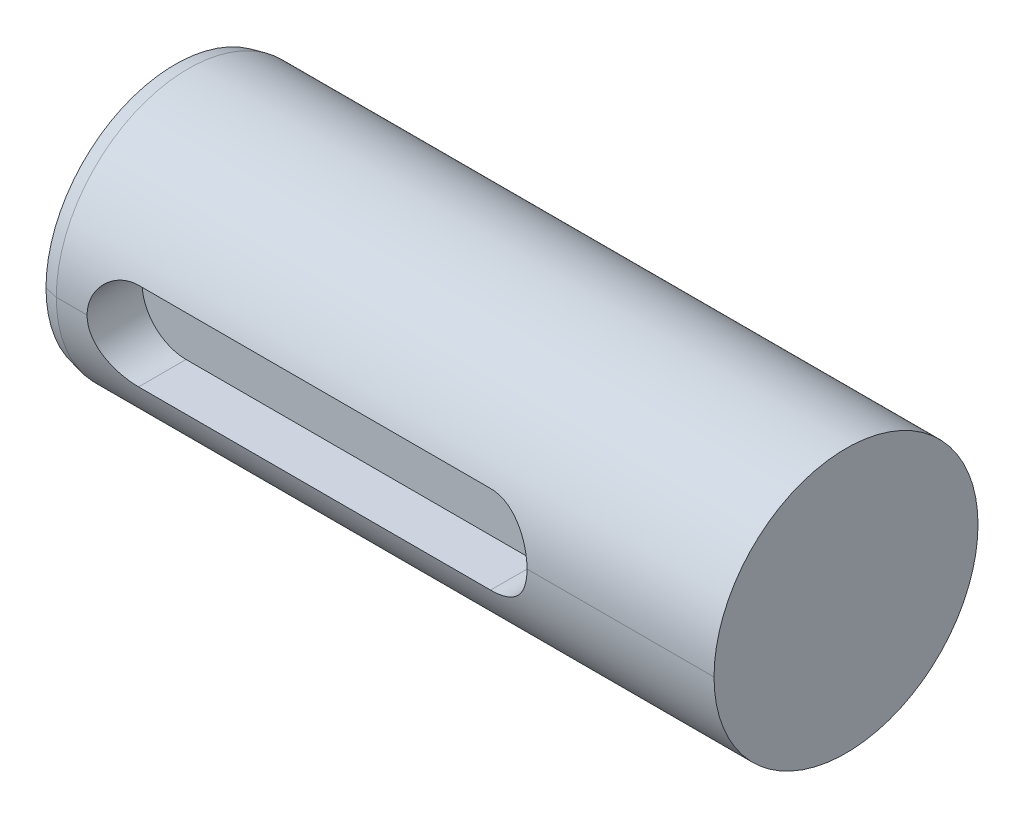
ISO-10303-21;
HEADER;
FILE_DESCRIPTION(('STEP AP214'),'2;1');
FILE_NAME('part.step','',(''),(''),'','','');
FILE_SCHEMA(('AUTOMOTIVE_DESIGN { 1 0 10303 214 1 1 1 1 }'));
ENDSEC;
DATA;
#1=APPLICATION_CONTEXT('core data for automotive mechanical design processes');
#2=APPLICATION_PROTOCOL_DEFINITION('international standard','automotive_design',2000,#1);
#3=PRODUCT_CONTEXT('',#1,'mechanical');
#4=PRODUCT('Part','Part','',(#3));
#5=PRODUCT_RELATED_PRODUCT_CATEGORY('part','',(#4));
#6=PRODUCT_DEFINITION_FORMATION('','',#4);
#7=PRODUCT_DEFINITION_CONTEXT('part definition',#1,'design');
#8=PRODUCT_DEFINITION('design','',#6,#7);
#9=PRODUCT_DEFINITION_SHAPE('','',#8);
#10=(LENGTH_UNIT() NAMED_UNIT(*) SI_UNIT(.MILLI.,.METRE.));
#11=(NAMED_UNIT(*) PLANE_ANGLE_UNIT() SI_UNIT($,.RADIAN.));
#12=(NAMED_UNIT(*) SI_UNIT($,.STERADIAN.) SOLID_ANGLE_UNIT());
#13=UNCERTAINTY_MEASURE_WITH_UNIT(LENGTH_MEASURE(1.E-05),#10,'distance_accuracy_value','');
#14=(GEOMETRIC_REPRESENTATION_CONTEXT(3) GLOBAL_UNCERTAINTY_ASSIGNED_CONTEXT((#13)) GLOBAL_UNIT_ASSIGNED_CONTEXT((#10,
#11,#12)) REPRESENTATION_CONTEXT('',''));
#15=CARTESIAN_POINT('',(0.,0.,0.));
#16=DIRECTION('',(0.,0.,1.));
#17=DIRECTION('',(1.,0.,0.));
#18=AXIS2_PLACEMENT_3D('',#15,#16,#17);
#19=CARTESIAN_POINT('',(-29.5,0.,0.));
#20=DIRECTION('',(-1.,0.,0.));
#21=DIRECTION('',(0.,0.,1.));
#22=AXIS2_PLACEMENT_3D('',#19,#20,#21);
#23=PLANE('',#22);
#24=CARTESIAN_POINT('',(-29.5,0.,0.));
#25=DIRECTION('',(1.,0.,0.));
#26=DIRECTION('',(0.,0.,1.));
#27=AXIS2_PLACEMENT_3D('',#24,#25,#26);
#28=CIRCLE('',#27,1.675);
#29=CARTESIAN_POINT('',(-29.5,0.,1.675));
#30=VERTEX_POINT('',#29);
#31=CARTESIAN_POINT('',(-29.5,0.,-1.675));
#32=VERTEX_POINT('',#31);
#33=EDGE_CURVE('E278',#30,#32,#28,.T.);
#34=ORIENTED_EDGE('',*,*,#33,.T.);
#35=CARTESIAN_POINT('',(-29.5,0.,0.));
#36=DIRECTION('',(1.,0.,0.));
#37=DIRECTION('',(0.,0.,1.));
#38=AXIS2_PLACEMENT_3D('',#35,#36,#37);
#39=CIRCLE('',#38,1.675);
#40=EDGE_CURVE('E273',#32,#30,#39,.T.);
#41=ORIENTED_EDGE('',*,*,#40,.T.);
#42=EDGE_LOOP('',(#34,#41));
#43=FACE_BOUND('',#42,.T.);
#44=CARTESIAN_POINT('',(-29.5,0.,0.));
#45=DIRECTION('',(-1.,0.,0.));
#46=DIRECTION('',(0.,0.,1.));
#47=AXIS2_PLACEMENT_3D('',#44,#45,#46);
#48=CIRCLE('',#47,5.8669832024);
#49=CARTESIAN_POINT('',(-29.5,0.,5.8669832024));
#50=VERTEX_POINT('',#49);
#51=CARTESIAN_POINT('',(-29.5,0.,-5.8669832024));
#52=VERTEX_POINT('',#51);
#53=EDGE_CURVE('E258',#50,#52,#48,.T.);
#54=ORIENTED_EDGE('',*,*,#53,.T.);
#55=CARTESIAN_POINT('',(-29.5,0.,0.));
#56=DIRECTION('',(-1.,0.,0.));
#57=DIRECTION('',(0.,0.,1.));
#58=AXIS2_PLACEMENT_3D('',#55,#56,#57);
#59=CIRCLE('',#58,5.8669832024);
#60=EDGE_CURVE('E28',#52,#50,#59,.T.);
#61=ORIENTED_EDGE('',*,*,#60,.T.);
#62=EDGE_LOOP('',(#54,#61));
#63=FACE_BOUND('',#62,.T.);
#64=ADVANCED_FACE('F17',(#43,#63),#23,.T.);
#65=CARTESIAN_POINT('',(1.,0.,0.));
#66=DIRECTION('',(1.,0.,0.));
#67=DIRECTION('',(0.,1.,0.));
#68=AXIS2_PLACEMENT_3D('',#65,#66,#67);
#69=PLANE('',#68);
#70=CARTESIAN_POINT('',(1.,0.,0.));
#71=DIRECTION('',(1.,0.,0.));
#72=DIRECTION('',(0.,0.,-1.));
#73=AXIS2_PLACEMENT_3D('',#70,#71,#72);
#74=CIRCLE('',#73,6.);
#75=CARTESIAN_POINT('',(1.,0.,-6.));
#76=VERTEX_POINT('',#75);
#77=CARTESIAN_POINT('',(1.,0.,6.));
#78=VERTEX_POINT('',#77);
#79=EDGE_CURVE('E11',#76,#78,#74,.T.);
#80=ORIENTED_EDGE('',*,*,#79,.T.);
#81=CARTESIAN_POINT('',(1.,0.,0.));
#82=DIRECTION('',(1.,0.,0.));
#83=DIRECTION('',(0.,0.,-1.));
#84=AXIS2_PLACEMENT_3D('',#81,#82,#83);
#85=CIRCLE('',#84,6.);
#86=EDGE_CURVE('E229',#78,#76,#85,.T.);
#87=ORIENTED_EDGE('',*,*,#86,.T.);
#88=EDGE_LOOP('',(#80,#87));
#89=FACE_BOUND('',#88,.T.);
#90=ADVANCED_FACE('F241',(#89),#69,.T.);
#91=CARTESIAN_POINT('',(-14.25,0.,0.));
#92=DIRECTION('',(-1.,0.,0.));
#93=DIRECTION('',(0.,0.,-1.));
#94=AXIS2_PLACEMENT_3D('',#91,#92,#93);
#95=CYLINDRICAL_SURFACE('',#94,6.);
#96=DIRECTION('',(-1.,0.,0.));
#97=VECTOR('',#96,1.);
#98=CARTESIAN_POINT('',(-14.25,0.,-6.));
#99=LINE('',#98,#97);
#100=CARTESIAN_POINT('',(-28.9,0.,-6.));
#101=VERTEX_POINT('',#100);
#102=EDGE_CURVE('E307',#76,#101,#99,.T.);
#103=ORIENTED_EDGE('',*,*,#102,.T.);
#104=CARTESIAN_POINT('',(-28.9,0.,0.));
#105=DIRECTION('',(1.,0.,0.));
#106=DIRECTION('',(0.,0.,-1.));
#107=AXIS2_PLACEMENT_3D('',#104,#105,#106);
#108=CIRCLE('',#107,6.);
#109=CARTESIAN_POINT('',(-28.9,0.,6.));
#110=VERTEX_POINT('',#109);
#111=EDGE_CURVE('E132',#101,#110,#108,.T.);
#112=ORIENTED_EDGE('',*,*,#111,.T.);
#113=DIRECTION('',(1.,0.,0.));
#114=VECTOR('',#113,1.);
#115=CARTESIAN_POINT('',(-14.25,0.,6.));
#116=LINE('',#115,#114);
#117=CARTESIAN_POINT('',(-27.5,0.,6.));
#118=VERTEX_POINT('',#117);
#119=EDGE_CURVE('E128',#110,#118,#116,.T.);
#120=ORIENTED_EDGE('',*,*,#119,.T.);
#121=CARTESIAN_POINT('',(-27.5,0.,6.));
#122=CARTESIAN_POINT('',(-27.5000010622667,0.0264815051020842,6.00000040159053));
#123=CARTESIAN_POINT('',(-27.4994917975431,0.0529636239782276,5.99982469547121));
#124=CARTESIAN_POINT('',(-27.4974450615192,0.105745698341622,5.99912573292851));
#125=CARTESIAN_POINT('',(-27.4959129412316,0.132045885850833,5.99860428532929));
#126=CARTESIAN_POINT('',(-27.4918207458452,0.184459817791921,5.99722099459449));
#127=CARTESIAN_POINT('',(-27.4892644800857,0.210573892126665,5.99636041306981));
#128=CARTESIAN_POINT('',(-27.4831259048093,0.262611210001739,5.99430661852677));
#129=CARTESIAN_POINT('',(-27.4795458067782,0.288534742635982,5.99311412259291));
#130=CARTESIAN_POINT('',(-27.4713610960281,0.340187026605895,5.99040409774088));
#131=CARTESIAN_POINT('',(-27.4667570786095,0.365915882174413,5.9888867577041));
#132=CARTESIAN_POINT('',(-27.4565261757545,0.41717515143169,5.98553466605338));
#133=CARTESIAN_POINT('',(-27.4508982801145,0.442705342935138,5.98369960104504));
#134=CARTESIAN_POINT('',(-27.438621233358,0.493563956593501,5.97971963440224));
#135=CARTESIAN_POINT('',(-27.4319695075737,0.518891695863211,5.97757395247907));
#136=CARTESIAN_POINT('',(-27.417646304804,0.569342348010597,5.97298028892181));
#137=CARTESIAN_POINT('',(-27.4099707579355,0.594463995033601,5.97053110371581));
#138=CARTESIAN_POINT('',(-27.3936015791758,0.644499817029424,5.96533789239092));
#139=CARTESIAN_POINT('',(-27.3849024783169,0.669412037938014,5.96259228956049));
#140=CARTESIAN_POINT('',(-27.3664868388302,0.719026172348938,5.95681370940094));
#141=CARTESIAN_POINT('',(-27.3567635426073,0.743725354287814,5.95377883781351));
#142=CARTESIAN_POINT('',(-27.336451337416,0.792557110013461,5.94747471857231));
#143=CARTESIAN_POINT('',(-27.3258680157853,0.816692206224733,5.94420699845671));
#144=CARTESIAN_POINT('',(-27.303843613575,0.864385001218804,5.93745868602232));
#145=CARTESIAN_POINT('',(-27.2924072165076,0.887945028488827,5.93397927292969));
#146=CARTESIAN_POINT('',(-27.2686772847938,0.934487160387967,5.92682765259434));
#147=CARTESIAN_POINT('',(-27.2563870984522,0.957471089493592,5.92315621104158));
#148=CARTESIAN_POINT('',(-27.2309511371597,1.00286153149201,5.91564001229878));
#149=CARTESIAN_POINT('',(-27.217807371464,1.02526923862596,5.91179566823323));
#150=CARTESIAN_POINT('',(-27.1906655436833,1.06950807729945,5.90395263633814));
#151=CARTESIAN_POINT('',(-27.1766681774278,1.09133965821666,5.89995407517381));
#152=CARTESIAN_POINT('',(-27.1478204972931,1.13442758824464,5.8918210314342));
#153=CARTESIAN_POINT('',(-27.1329696146392,1.15568353955291,5.88768645902576));
#154=CARTESIAN_POINT('',(-27.1024160813128,1.19762186190489,5.87929929305596));
#155=CARTESIAN_POINT('',(-27.0867116684968,1.21830290192544,5.87504646492601));
#156=CARTESIAN_POINT('',(-27.054452534209,1.25909374362213,5.86644006218271));
#157=CARTESIAN_POINT('',(-27.0378949495142,1.27920121530156,5.86208617946226));
#158=CARTESIAN_POINT('',(-27.0039295017292,1.31884636245411,5.85329468480186));
#159=CARTESIAN_POINT('',(-26.9865177760832,1.33838065794447,5.84885676159391));
#160=CARTESIAN_POINT('',(-26.9508489601942,1.37688574971296,5.83991256417107));
#161=CARTESIAN_POINT('',(-26.9325871573702,1.3958521192774,5.83540603400338));
#162=CARTESIAN_POINT('',(-26.8957524189181,1.43266273178863,5.82647648620267));
#163=CARTESIAN_POINT('',(-26.8771948172466,1.45052238921856,5.82205377670962));
#164=CARTESIAN_POINT('',(-26.8394622091763,1.48545138193919,5.8132398602292));
#165=CARTESIAN_POINT('',(-26.8202894973735,1.50252318065863,5.80884859729947));
#166=CARTESIAN_POINT('',(-26.7813316102107,1.53588469602879,5.80011679916009));
#167=CARTESIAN_POINT('',(-26.7615477171855,1.55217588855491,5.79577618099214));
#168=CARTESIAN_POINT('',(-26.7213673757624,1.58398004600127,5.78716498065555));
#169=CARTESIAN_POINT('',(-26.7009712708759,1.5994934347634,5.78289436121623));
#170=CARTESIAN_POINT('',(-26.6595679349644,1.62974732272232,5.77444115050264));
#171=CARTESIAN_POINT('',(-26.6385601837985,1.64448713234323,5.77025863969224));
#172=CARTESIAN_POINT('',(-26.5952149846941,1.67368246320706,5.76185958809302));
#173=CARTESIAN_POINT('',(-26.5728569029923,1.68810857938235,5.7576472562398));
#174=CARTESIAN_POINT('',(-26.5276679742411,1.71600324063555,5.749395053627));
#175=CARTESIAN_POINT('',(-26.5048398316696,1.72947595388127,5.74535446757274));
#176=CARTESIAN_POINT('',(-26.4587118277726,1.7554701160133,5.737465346896));
#177=CARTESIAN_POINT('',(-26.4354136646449,1.76799440764819,5.73361625126059));
#178=CARTESIAN_POINT('',(-26.3883470543701,1.79209906422151,5.72612783279239));
#179=CARTESIAN_POINT('',(-26.3645793858135,1.80368085160006,5.72248819636687));
#180=CARTESIAN_POINT('',(-26.3165729881941,1.82590299193349,5.71543648964043));
#181=CARTESIAN_POINT('',(-26.292334227447,1.8365432812972,5.71202443471476));
#182=CARTESIAN_POINT('',(-26.2433303623337,1.85692858361899,5.70542999192365));
#183=CARTESIAN_POINT('',(-26.2185634661674,1.86666962202877,5.70224863585191));
#184=CARTESIAN_POINT('',(-26.168841506278,1.88510788899843,5.69617956781793));
#185=CARTESIAN_POINT('',(-26.1438896340131,1.89381299672269,5.69328966874155));
#186=CARTESIAN_POINT('',(-26.0937970120154,1.9101813523451,5.68781866898251));
#187=CARTESIAN_POINT('',(-26.0686585971075,1.91785109970207,5.68523565541998));
#188=CARTESIAN_POINT('',(-26.0181941979839,1.93215525218724,5.68039020027967));
#189=CARTESIAN_POINT('',(-25.9928697652543,1.93879460984353,5.67812623039127));
#190=CARTESIAN_POINT('',(-25.9420339902878,1.9510428659721,5.67392928445135));
#191=CARTESIAN_POINT('',(-25.9165235324772,1.9566550698818,5.67199524807052));
#192=CARTESIAN_POINT('',(-25.8653163907443,1.96685385031838,5.6684667245814));
#193=CARTESIAN_POINT('',(-25.8396200570348,1.9714420041239,5.66687171547436));
#194=CARTESIAN_POINT('',(-25.7880416774322,1.97959694032729,5.66402812784972));
#195=CARTESIAN_POINT('',(-25.7621595964732,1.9831635243792,5.66277961660891));
#196=CARTESIAN_POINT('',(-25.710210056979,1.98927920697599,5.66063412421464));
#197=CARTESIAN_POINT('',(-25.6841423362121,1.99182631806828,5.65973782976558));
#198=CARTESIAN_POINT('',(-25.6318218199281,1.99590595124421,5.65830048746858));
#199=CARTESIAN_POINT('',(-25.6055686962839,1.9974347165162,5.65776075508471));
#200=CARTESIAN_POINT('',(-25.5528770165069,1.99948154575924,5.65703753658944));
#201=CARTESIAN_POINT('',(-25.5264382209928,1.99999414529774,5.65685597657566));
#202=CARTESIAN_POINT('',(-25.5,2.,5.65685424949238));
#203=B_SPLINE_CURVE_WITH_KNOTS('',3,(#121,#122,#123,#124,#125,#126,#127,#128,#129,#130,#131,
#132,#133,#134,#135,#136,#137,#138,#139,#140,#141,#142,#143,#144,#145,#146,#147,#148,#149,#150,
#151,#152,#153,#154,#155,#156,#157,#158,#159,#160,#161,#162,#163,#164,#165,#166,#167,#168,#169,
#170,#171,#172,#173,#174,#175,#176,#177,#178,#179,#180,#181,#182,#183,#184,#185,#186,#187,#188,
#189,#190,#191,#192,#193,#194,#195,#196,#197,#198,#199,#200,#201,#202),.UNSPECIFIED.,.F.,.F.,(4,
2,2,2,2,2,2,2,2,2,2,2,2,2,2,2,2,2,2,2,2,2,2,2,2,2,2,2,2,2,2,2,2,2,2,2,2,2,2,2,4),(0.,
0.0794398922250769,0.15846742200738,0.237203695743882,0.315771166701245,0.394293077887395,
0.472892886625238,0.551693684116004,0.630817623550459,0.710385369865159,0.79051558309171,
0.870161458109303,0.949398363383198,1.02834038192732,1.10710287825197,1.18580200645599,
1.2645542011306,1.34347566209524,1.42268184429952,1.50228696396264,1.58240353120542,
1.66078279786654,1.73889759018419,1.81685834034017,1.89477613571227,1.97276224745478,
2.05355979199919,2.13397893864101,2.21414662547681,2.29419098728216,2.37424075136567,
2.45462889386628,2.53436013424971,2.6135649438602,2.69237640889108,2.77092961506499,
2.8493609827792,2.92780756826662,3.00640634830701,3.08529350700446,3.16460374302333),.UNSPECIFIED.);
#204=CARTESIAN_POINT('',(-25.5,2.,5.65685424949238));
#205=VERTEX_POINT('',#204);
#206=EDGE_CURVE('E108',#118,#205,#203,.T.);
#207=ORIENTED_EDGE('',*,*,#206,.T.);
#208=DIRECTION('',(1.,0.,0.));
#209=VECTOR('',#208,1.);
#210=CARTESIAN_POINT('',(-17.5,2.,5.65685424949238));
#211=LINE('',#210,#209);
#212=CARTESIAN_POINT('',(-9.5,2.,5.65685424949238));
#213=VERTEX_POINT('',#212);
#214=EDGE_CURVE('E124',#205,#213,#211,.T.);
#215=ORIENTED_EDGE('',*,*,#214,.T.);
#216=CARTESIAN_POINT('',(-9.5,2.,5.65685424949238));
#217=CARTESIAN_POINT('',(-9.47356485859988,1.99999414695232,5.65685597604953));
#218=CARTESIAN_POINT('',(-9.44712914642681,1.99948153463551,5.65703754053541));
#219=CARTESIAN_POINT('',(-9.39444294663558,1.99743470631074,5.65776075867563));
#220=CARTESIAN_POINT('',(-9.36819222076565,1.99590592846793,5.65830049549101));
#221=CARTESIAN_POINT('',(-9.31587581442195,1.9918262964541,5.65973783738275));
#222=CARTESIAN_POINT('',(-9.28980980813487,1.98927917224759,5.6606341363963));
#223=CARTESIAN_POINT('',(-9.23786301012374,1.98316349050954,5.66277962849272));
#224=CARTESIAN_POINT('',(-9.21198195970868,1.97959689347982,5.66402814418414));
#225=CARTESIAN_POINT('',(-9.16040495283284,1.97144195785919,5.66687173160771));
#226=CARTESIAN_POINT('',(-9.13470896600956,1.96685379100518,5.66846674508874));
#227=CARTESIAN_POINT('',(-9.08350182778731,1.95665501207669,5.67199526808321));
#228=CARTESIAN_POINT('',(-9.05799103233469,1.95104279690612,5.6739293081364));
#229=CARTESIAN_POINT('',(-9.00715389347639,1.93879453904943,5.67812625463013));
#230=CARTESIAN_POINT('',(-8.98182844107061,1.93215516628862,5.68039022929173));
#231=CARTESIAN_POINT('',(-8.93136130327359,1.91785102496964,5.68523568082125));
#232=CARTESIAN_POINT('',(-8.90622117647088,1.91018128091033,5.68781869306105));
#233=CARTESIAN_POINT('',(-8.85612446817784,1.89381288903177,5.69328970453308));
#234=CARTESIAN_POINT('',(-8.83117022914924,1.8851077200752,5.69617962298697));
#235=CARTESIAN_POINT('',(-8.78144273221724,1.86666959706124,5.70224864450677));
#236=CARTESIAN_POINT('',(-8.75667267223609,1.85692874676068,5.70542993924865));
#237=CARTESIAN_POINT('',(-8.70767515605245,1.83654827881266,5.71202281796892));
#238=CARTESIAN_POINT('',(-8.68344569230316,1.82591311488738,5.71543324554528));
#239=CARTESIAN_POINT('',(-8.63545324707224,1.80369866613942,5.72248257504914));
#240=CARTESIAN_POINT('',(-8.61169032787113,1.79211925631538,5.72612150721187));
#241=CARTESIAN_POINT('',(-8.56462839816827,1.76801712094051,5.73360924773625));
#242=CARTESIAN_POINT('',(-8.54133026795625,1.75549278718843,5.73745841067795));
#243=CARTESIAN_POINT('',(-8.49519762228035,1.72949609542293,5.74534841038693));
#244=CARTESIAN_POINT('',(-8.4723649135956,1.71602071295681,5.74938984397652));
#245=CARTESIAN_POINT('',(-8.42716183250088,1.6881186800214,5.75764430900573));
#246=CARTESIAN_POINT('',(-8.40479427617528,1.67368768898991,5.76185808470608));
#247=CARTESIAN_POINT('',(-8.36144786465288,1.64449352933254,5.7702567993845));
#248=CARTESIAN_POINT('',(-8.34044791250856,1.62976042909095,5.77443743383177));
#249=CARTESIAN_POINT('',(-8.29905633310438,1.59951655401926,5.78288795600314));
#250=CARTESIAN_POINT('',(-8.2786643039302,1.58400631201933,5.78715778143523));
#251=CARTESIAN_POINT('',(-8.23848795237252,1.55220543391241,5.79576826878153));
#252=CARTESIAN_POINT('',(-8.21870409870564,1.53591421949564,5.80010898156926));
#253=CARTESIAN_POINT('',(-8.17974226988271,1.50254944840884,5.80884181255407));
#254=CARTESIAN_POINT('',(-8.16056570726693,1.48547426601476,5.81323402207834));
#255=CARTESIAN_POINT('',(-8.12282109505745,1.45053554090032,5.8220505217931));
#256=CARTESIAN_POINT('',(-8.10425547312941,1.43266939164348,5.82647487054285));
#257=CARTESIAN_POINT('',(-8.06741633057705,1.39585685838307,5.83540488449656));
#258=CARTESIAN_POINT('',(-8.04915770616883,1.3768954982318,5.83991024944212));
#259=CARTESIAN_POINT('',(-8.01349468731219,1.33839919618665,5.84885250534988));
#260=CARTESIAN_POINT('',(-7.99608561293493,1.3188686503859,5.85328964930529));
#261=CARTESIAN_POINT('',(-7.96212463607261,1.27923001745476,5.86207988489911));
#262=CARTESIAN_POINT('',(-7.94556890830341,1.25912527766902,5.86643328439329));
#263=CARTESIAN_POINT('',(-7.91331272471218,1.21833884052712,5.87503900610551));
#264=CARTESIAN_POINT('',(-7.89760944503334,1.19765944111698,5.87929163193074));
#265=CARTESIAN_POINT('',(-7.86705739384537,1.15572335041325,5.88767864247085));
#266=CARTESIAN_POINT('',(-7.8522069016591,1.13446795880738,5.89181325616017));
#267=CARTESIAN_POINT('',(-7.823359220538,1.09138008621714,5.89994659895339));
#268=CARTESIAN_POINT('',(-7.80936150575822,1.06954797300997,5.90394541110877));
#269=CARTESIAN_POINT('',(-7.78221820002041,1.02530699936406,5.91178912573054));
#270=CARTESIAN_POINT('',(-7.76907334867329,1.0028976612661,5.91563389353185));
#271=CARTESIAN_POINT('',(-7.74363442137363,0.957502884234824,5.92315108230083));
#272=CARTESIAN_POINT('',(-7.73134239859954,0.934516224898189,5.92682308092979));
#273=CARTESIAN_POINT('',(-7.70760804999308,0.887967530559982,5.93397592119898));
#274=CARTESIAN_POINT('',(-7.69616911605264,0.864403647205236,5.93745598677595));
#275=CARTESIAN_POINT('',(-7.67413870648908,0.816702110579628,5.94420565823705));
#276=CARTESIAN_POINT('',(-7.66355195579534,0.792562107869086,5.94747407337428));
#277=CARTESIAN_POINT('',(-7.64323651357806,0.743728425363208,5.95377844132242));
#278=CARTESIAN_POINT('',(-7.63351310443209,0.719032360472537,5.95681294982285));
#279=CARTESIAN_POINT('',(-7.61509737436794,0.669423730585017,5.96259096626707));
#280=CARTESIAN_POINT('',(-7.60639831463208,0.644513889718154,5.96533636187048));
#281=CARTESIAN_POINT('',(-7.59002915684575,0.594482172533458,5.97052928655924));
#282=CARTESIAN_POINT('',(-7.58235361183955,0.569362242483831,5.97297838543491));
#283=CARTESIAN_POINT('',(-7.56803040116392,0.518914344761773,5.97757198182593));
#284=CARTESIAN_POINT('',(-7.56137868910361,0.493587635670083,5.97971767557067));
#285=CARTESIAN_POINT('',(-7.54910164282264,0.442730405142188,5.98369774523094));
#286=CARTESIAN_POINT('',(-7.54347375893872,0.417200559962138,5.98553289368551));
#287=CARTESIAN_POINT('',(-7.53324285492254,0.365941301829493,5.98888520595226));
#288=CARTESIAN_POINT('',(-7.52863885070263,0.340212105316033,5.99040267501456));
#289=CARTESIAN_POINT('',(-7.52045413969814,0.288558455983267,5.99311298531873));
#290=CARTESIAN_POINT('',(-7.51687405506052,0.262633894233437,5.99430562917164));
#291=CARTESIAN_POINT('',(-7.51073547967523,0.210593832554145,5.99635972026476));
#292=CARTESIAN_POINT('',(-7.50817922756977,0.184478039993161,5.99722044159489));
#293=CARTESIAN_POINT('',(-7.50408703209531,0.132059985322707,5.99860398549401));
#294=CARTESIAN_POINT('',(-7.50255492511617,0.105757390989219,5.99912553735755));
#295=CARTESIAN_POINT('',(-7.50050818958721,0.0529698141638515,5.99982465450454));
#296=CARTESIAN_POINT('',(-7.49999893854767,0.0264845985123932,6.00000040167421));
#297=CARTESIAN_POINT('',(-7.5,0.,6.));
#298=B_SPLINE_CURVE_WITH_KNOTS('',3,(#216,#217,#218,#219,#220,#221,#222,#223,#224,#225,#226,
#227,#228,#229,#230,#231,#232,#233,#234,#235,#236,#237,#238,#239,#240,#241,#242,#243,#244,#245,
#246,#247,#248,#249,#250,#251,#252,#253,#254,#255,#256,#257,#258,#259,#260,#261,#262,#263,#264,
#265,#266,#267,#268,#269,#270,#271,#272,#273,#274,#275,#276,#277,#278,#279,#280,#281,#282,#283,
#284,#285,#286,#287,#288,#289,#290,#291,#292,#293,#294,#295,#296,#297),.UNSPECIFIED.,.F.,.F.,(4,
2,2,2,2,2,2,2,2,2,2,2,2,2,2,2,2,2,2,2,2,2,2,2,2,2,2,2,2,2,2,2,2,2,2,2,2,2,2,2,4),(0.,
0.0793009908341656,0.15818097093735,0.236774640922532,0.315218176265456,0.393648534347742,
0.472202741319117,0.551017177171284,0.630226877523411,0.709964869622223,0.790361558063819,
0.870379218068263,0.950407488237918,1.03057517507371,1.11101041498995,1.19184007164411,
1.26979495185215,1.3476970964933,1.42565784664927,1.50378829263419,1.58219880327414,
1.66229758917844,1.7418888025095,1.82108501053652,1.90000047079576,1.97875066273761,
2.05745179322175,2.13622028614961,2.21517226732054,2.2944230558413,2.37408667308533,
2.45420823521695,2.53376915704821,2.6128881598278,2.69168596228675,2.77028476314639,
2.84880769019846,2.92737822793665,3.00611963685753,3.085154377999,3.16460355600081),.UNSPECIFIED.);
#299=CARTESIAN_POINT('',(-7.5,0.,6.));
#300=VERTEX_POINT('',#299);
#301=EDGE_CURVE('E252',#213,#300,#298,.T.);
#302=ORIENTED_EDGE('',*,*,#301,.T.);
#303=DIRECTION('',(1.,0.,0.));
#304=VECTOR('',#303,1.);
#305=CARTESIAN_POINT('',(-14.25,0.,6.));
#306=LINE('',#305,#304);
#307=EDGE_CURVE('E225',#300,#78,#306,.T.);
#308=ORIENTED_EDGE('',*,*,#307,.T.);
#309=ORIENTED_EDGE('',*,*,#79,.F.);
#310=EDGE_LOOP('',(#103,#112,#120,#207,#215,#302,#308,#309));
#311=FACE_BOUND('',#310,.T.);
#312=ADVANCED_FACE('F130',(#311),#95,.T.);
#313=CARTESIAN_POINT('',(-29.2,0.,0.));
#314=DIRECTION('',(1.,0.,0.));
#315=DIRECTION('',(0.,0.,1.));
#316=AXIS2_PLACEMENT_3D('',#313,#314,#315);
#317=CONICAL_SURFACE('',#316,5.9334916012,0.218166156521907);
#318=DIRECTION('',(-0.976296007115039,0.,-0.216439613960182));
#319=VECTOR('',#318,1.);
#320=CARTESIAN_POINT('',(-29.2,0.,5.9334916012));
#321=LINE('',#320,#319);
#322=EDGE_CURVE('E268',#110,#50,#321,.T.);
#323=ORIENTED_EDGE('',*,*,#322,.T.);
#324=ORIENTED_EDGE('',*,*,#60,.F.);
#325=DIRECTION('',(0.976296007115039,0.,-0.216439613960182));
#326=VECTOR('',#325,1.);
#327=CARTESIAN_POINT('',(-29.2,0.,-5.9334916012));
#328=LINE('',#327,#326);
#329=EDGE_CURVE('E267',#52,#101,#328,.T.);
#330=ORIENTED_EDGE('',*,*,#329,.T.);
#331=CARTESIAN_POINT('',(-28.9,0.,0.));
#332=DIRECTION('',(1.,0.,0.));
#333=DIRECTION('',(0.,0.,-1.));
#334=AXIS2_PLACEMENT_3D('',#331,#332,#333);
#335=CIRCLE('',#334,6.);
#336=EDGE_CURVE('E137',#110,#101,#335,.T.);
#337=ORIENTED_EDGE('',*,*,#336,.F.);
#338=EDGE_LOOP('',(#323,#324,#330,#337));
#339=FACE_BOUND('',#338,.T.);
#340=ADVANCED_FACE('F240',(#339),#317,.T.);
#341=CARTESIAN_POINT('',(-17.5,0.,3.5));
#342=DIRECTION('',(0.,0.,1.));
#343=DIRECTION('',(1.,0.,0.));
#344=AXIS2_PLACEMENT_3D('',#341,#342,#343);
#345=PLANE('',#344);
#346=DIRECTION('',(1.,0.,0.));
#347=VECTOR('',#346,1.);
#348=CARTESIAN_POINT('',(-25.5,-2.,3.5));
#349=LINE('',#348,#347);
#350=CARTESIAN_POINT('',(-25.5,-2.,3.5));
#351=VERTEX_POINT('',#350);
#352=CARTESIAN_POINT('',(-9.5,-2.,3.5));
#353=VERTEX_POINT('',#352);
#354=EDGE_CURVE('E322',#351,#353,#349,.T.);
#355=ORIENTED_EDGE('',*,*,#354,.T.);
#356=CARTESIAN_POINT('',(-9.5,0.,3.5));
#357=DIRECTION('',(0.,0.,1.));
#358=DIRECTION('',(0.,-1.,0.));
#359=AXIS2_PLACEMENT_3D('',#356,#357,#358);
#360=CIRCLE('',#359,2.);
#361=CARTESIAN_POINT('',(-9.5,2.,3.5));
#362=VERTEX_POINT('',#361);
#363=EDGE_CURVE('E42',#353,#362,#360,.T.);
#364=ORIENTED_EDGE('',*,*,#363,.T.);
#365=DIRECTION('',(-1.,0.,0.));
#366=VECTOR('',#365,1.);
#367=CARTESIAN_POINT('',(-9.5,2.,3.5));
#368=LINE('',#367,#366);
#369=CARTESIAN_POINT('',(-25.5,2.,3.5));
#370=VERTEX_POINT('',#369);
#371=EDGE_CURVE('E218',#362,#370,#368,.T.);
#372=ORIENTED_EDGE('',*,*,#371,.T.);
#373=CARTESIAN_POINT('',(-25.5,0.,3.5));
#374=DIRECTION('',(0.,0.,1.));
#375=DIRECTION('',(0.,1.,0.));
#376=AXIS2_PLACEMENT_3D('',#373,#374,#375);
#377=CIRCLE('',#376,2.);
#378=EDGE_CURVE('E297',#370,#351,#377,.T.);
#379=ORIENTED_EDGE('',*,*,#378,.T.);
#380=EDGE_LOOP('',(#355,#364,#372,#379));
#381=FACE_BOUND('',#380,.T.);
#382=ADVANCED_FACE('F198',(#381),#345,.T.);
#383=CARTESIAN_POINT('',(-9.5,0.,6.));
#384=DIRECTION('',(0.,0.,-1.));
#385=DIRECTION('',(0.,-1.,0.));
#386=AXIS2_PLACEMENT_3D('',#383,#384,#385);
#387=CYLINDRICAL_SURFACE('',#386,2.);
#388=CARTESIAN_POINT('',(-7.5,0.,6.));
#389=CARTESIAN_POINT('',(-7.49999893773333,-0.026481505105765,6.00000040159053));
#390=CARTESIAN_POINT('',(-7.5005082024569,-0.0529636239856185,5.99982469547116));
#391=CARTESIAN_POINT('',(-7.50255493848076,-0.105745698355606,5.99912573292828));
#392=CARTESIAN_POINT('',(-7.50408705876838,-0.132045885867702,5.99860428532893));
#393=CARTESIAN_POINT('',(-7.50817925415477,-0.184459817813732,5.99722099459383));
#394=CARTESIAN_POINT('',(-7.51073551991428,-0.210573892150536,5.99636041306898));
#395=CARTESIAN_POINT('',(-7.51687409519061,-0.262611210028898,5.99430661852559));
#396=CARTESIAN_POINT('',(-7.52045419322173,-0.288534742664375,5.99311412259155));
#397=CARTESIAN_POINT('',(-7.52863890397181,-0.340187026635924,5.99040409773918));
#398=CARTESIAN_POINT('',(-7.53324292139045,-0.365915882204852,5.98888675770224));
#399=CARTESIAN_POINT('',(-7.54347382424544,-0.417175151462117,5.98553466605126));
#400=CARTESIAN_POINT('',(-7.54910171988543,-0.442705342965151,5.98369960104282));
#401=CARTESIAN_POINT('',(-7.56137876664193,-0.493563956621856,5.97971963439989));
#402=CARTESIAN_POINT('',(-7.56803049242624,-0.51889169589033,5.97757395247672));
#403=CARTESIAN_POINT('',(-7.58235369519594,-0.569342348034414,5.97298028891953));
#404=CARTESIAN_POINT('',(-7.59002924206439,-0.59446399505536,5.97053110371364));
#405=CARTESIAN_POINT('',(-7.60639842082405,-0.644499817046264,5.96533789238909));
#406=CARTESIAN_POINT('',(-7.61509752168296,-0.669412037952,5.96259228955891));
#407=CARTESIAN_POINT('',(-7.63351316116973,-0.719026172356338,5.95681370940003));
#408=CARTESIAN_POINT('',(-7.64323645739274,-0.74372535429149,5.95377883781303));
#409=CARTESIAN_POINT('',(-7.66354866258663,-0.792557110016178,5.94747471857196));
#410=CARTESIAN_POINT('',(-7.67413198422014,-0.816692206230103,5.94420699845598));
#411=CARTESIAN_POINT('',(-7.69615638643519,-0.864385001228922,5.93745868602085));
#412=CARTESIAN_POINT('',(-7.70759278350459,-0.887945028501051,5.93397927292787));
#413=CARTESIAN_POINT('',(-7.73132271522194,-0.934487160403769,5.92682765259186));
#414=CARTESIAN_POINT('',(-7.74361290156495,-0.95747108951088,5.92315621103879));
#415=CARTESIAN_POINT('',(-7.76904886285979,-1.00286153151166,5.91564001229545));
#416=CARTESIAN_POINT('',(-7.78219262855644,-1.0252692386465,5.91179566822967));
#417=CARTESIAN_POINT('',(-7.80933445633825,-1.06950807732115,5.90395263633421));
#418=CARTESIAN_POINT('',(-7.823331822594,-1.09133965823866,5.89995407516975));
#419=CARTESIAN_POINT('',(-7.85217950272876,-1.1344275882666,5.89182103142997));
#420=CARTESIAN_POINT('',(-7.86703038538228,-1.15568353957457,5.88768645902151));
#421=CARTESIAN_POINT('',(-7.89758391870749,-1.19762186192533,5.8792992930518));
#422=CARTESIAN_POINT('',(-7.91328833152265,-1.21830290194498,5.87504646492196));
#423=CARTESIAN_POINT('',(-7.9455474658081,-1.25909374363927,5.86644006217903));
#424=CARTESIAN_POINT('',(-7.96210505050144,-1.27920121531722,5.86208617945884));
#425=CARTESIAN_POINT('',(-7.99607049828284,-1.31884636246621,5.85329468479912));
#426=CARTESIAN_POINT('',(-8.01348222392676,-1.33838065795451,5.84885676159161));
#427=CARTESIAN_POINT('',(-8.04915103981106,-1.37688574971825,5.83991256416982));
#428=CARTESIAN_POINT('',(-8.06741284263245,-1.39585211928002,5.83540603400275));
#429=CARTESIAN_POINT('',(-8.10424758108262,-1.43266273178945,5.82647648620247));
#430=CARTESIAN_POINT('',(-8.12280518275491,-1.45052238922014,5.82205377670923));
#431=CARTESIAN_POINT('',(-8.1605377908264,-1.48545138194191,5.8132398602285));
#432=CARTESIAN_POINT('',(-8.17971050262954,-1.50252318066175,5.80884859729866));
#433=CARTESIAN_POINT('',(-8.21866838979273,-1.5358846960323,5.80011679915916));
#434=CARTESIAN_POINT('',(-8.23845228281792,-1.55217588855841,5.7957761809912));
#435=CARTESIAN_POINT('',(-8.27863262424069,-1.58398004600439,5.78716498065469));
#436=CARTESIAN_POINT('',(-8.29902872912677,-1.59949343476616,5.78289436121546));
#437=CARTESIAN_POINT('',(-8.34043206503714,-1.62974732272387,5.7744411505022));
#438=CARTESIAN_POINT('',(-8.36143981620232,-1.64448713234395,5.77025863969203));
#439=CARTESIAN_POINT('',(-8.40478501531091,-1.67368246321027,5.76185958809209));
#440=CARTESIAN_POINT('',(-8.4271430970178,-1.68810857938866,5.75764725623796));
#441=CARTESIAN_POINT('',(-8.47233202577663,-1.71600324064649,5.74939505362374));
#442=CARTESIAN_POINT('',(-8.4951601683505,-1.72947595389384,5.74535446756896));
#443=CARTESIAN_POINT('',(-8.5412881722501,-1.75547011602742,5.73746534689168));
#444=CARTESIAN_POINT('',(-8.56458633537771,-1.76799440766234,5.73361625125623));
#445=CARTESIAN_POINT('',(-8.61165294565006,-1.79209906423411,5.72612783278844));
#446=CARTESIAN_POINT('',(-8.63542061420402,-1.80368085161119,5.72248819636336));
#447=CARTESIAN_POINT('',(-8.68342701181598,-1.82590299193983,5.7154364896384));
#448=CARTESIAN_POINT('',(-8.70766577255803,-1.83654328130035,5.71202443471375));
#449=CARTESIAN_POINT('',(-8.756669637669,-1.8569285836191,5.70542999192362));
#450=CARTESIAN_POINT('',(-8.78143653383817,-1.86666962202874,5.70224863585192));
#451=CARTESIAN_POINT('',(-8.8311584937325,-1.88510788899829,5.69617956781797));
#452=CARTESIAN_POINT('',(-8.85611036599952,-1.8938129967226,5.69328966874158));
#453=CARTESIAN_POINT('',(-8.90620298800082,-1.91018135234503,5.68781866898253));
#454=CARTESIAN_POINT('',(-8.9313414029103,-1.917851099702,5.68523565542));
#455=CARTESIAN_POINT('',(-8.98180580203634,-1.93215525218716,5.68039020027969));
#456=CARTESIAN_POINT('',(-9.00713023476685,-1.93879460984347,5.67812623039129));
#457=CARTESIAN_POINT('',(-9.05796600973463,-1.95104286597204,5.67392928445137));
#458=CARTESIAN_POINT('',(-9.08347646754548,-1.95665506988175,5.67199524807054));
#459=CARTESIAN_POINT('',(-9.1346836092784,-1.96685385031833,5.66846672458142));
#460=CARTESIAN_POINT('',(-9.16037994298753,-1.97144200412386,5.66687171547438));
#461=CARTESIAN_POINT('',(-9.21195832258897,-1.97959694032725,5.66402812784973));
#462=CARTESIAN_POINT('',(-9.237840403547,-1.98316352437917,5.66277961660893));
#463=CARTESIAN_POINT('',(-9.2897899430388,-1.98927920697596,5.66063412421465));
#464=CARTESIAN_POINT('',(-9.31585766380411,-1.99182631806826,5.65973782976559));
#465=CARTESIAN_POINT('',(-9.36817818008444,-1.9959059512442,5.65830048746858));
#466=CARTESIAN_POINT('',(-9.39443130372653,-1.9974347165162,5.65776075508471));
#467=CARTESIAN_POINT('',(-9.44712298349857,-1.99948154575924,5.65703753658944));
#468=CARTESIAN_POINT('',(-9.47356177901,-1.99999414529775,5.65685597657566));
#469=CARTESIAN_POINT('',(-9.5,-2.00000000000001,5.65685424949238));
#470=B_SPLINE_CURVE_WITH_KNOTS('',3,(#388,#389,#390,#391,#392,#393,#394,#395,#396,#397,#398,
#399,#400,#401,#402,#403,#404,#405,#406,#407,#408,#409,#410,#411,#412,#413,#414,#415,#416,#417,
#418,#419,#420,#421,#422,#423,#424,#425,#426,#427,#428,#429,#430,#431,#432,#433,#434,#435,#436,
#437,#438,#439,#440,#441,#442,#443,#444,#445,#446,#447,#448,#449,#450,#451,#452,#453,#454,#455,
#456,#457,#458,#459,#460,#461,#462,#463,#464,#465,#466,#467,#468,#469),.UNSPECIFIED.,.F.,.F.,(4,
2,2,2,2,2,2,2,2,2,2,2,2,2,2,2,2,2,2,2,2,2,2,2,2,2,2,2,2,2,2,2,2,2,2,2,2,2,2,2,4),(0.,
0.0794398922362017,0.158467422027147,0.237203695769807,0.315771166730844,0.394293077918213,
0.472892886654852,0.551693684142026,0.630817623570566,0.710385369877094,0.790515583093278,
0.87016145812154,0.949398363403841,1.02834038195404,1.10710287828238,1.18580200648764,
1.264554201161,1.34347566212187,1.42268184431984,1.50228696397411,1.58240353120549,
1.66078279786996,1.73889759018927,1.81685834034525,1.8947761357157,1.97276224745492,
2.05355979201737,2.1339789386682,2.21414662550399,2.29419098730037,2.37424075136602,
2.45462889387428,2.53436013426376,2.61356494387863,2.69237640891216,2.77092961508697,
2.84936098280028,2.92780756828498,3.00640634832079,3.08529350701182,3.16460374302242),.UNSPECIFIED.);
#471=CARTESIAN_POINT('',(-9.5,-2.,5.65685424949238));
#472=VERTEX_POINT('',#471);
#473=EDGE_CURVE('E182',#300,#472,#470,.T.);
#474=ORIENTED_EDGE('',*,*,#473,.F.);
#475=ORIENTED_EDGE('',*,*,#301,.F.);
#476=DIRECTION('',(0.,0.,-1.));
#477=VECTOR('',#476,1.);
#478=CARTESIAN_POINT('',(-9.5,2.,6.));
#479=LINE('',#478,#477);
#480=EDGE_CURVE('E210',#213,#362,#479,.T.);
#481=ORIENTED_EDGE('',*,*,#480,.T.);
#482=ORIENTED_EDGE('',*,*,#363,.F.);
#483=DIRECTION('',(0.,0.,-1.));
#484=VECTOR('',#483,1.);
#485=CARTESIAN_POINT('',(-9.5,-2.,6.));
#486=LINE('',#485,#484);
#487=EDGE_CURVE('E187',#472,#353,#486,.T.);
#488=ORIENTED_EDGE('',*,*,#487,.F.);
#489=EDGE_LOOP('',(#474,#475,#481,#482,#488));
#490=FACE_BOUND('',#489,.T.);
#491=ADVANCED_FACE('F188',(#490),#387,.F.);
#492=CARTESIAN_POINT('',(-17.5,-2.,6.));
#493=DIRECTION('',(0.,-1.,0.));
#494=DIRECTION('',(0.,0.,-1.));
#495=AXIS2_PLACEMENT_3D('',#492,#493,#494);
#496=PLANE('',#495);
#497=DIRECTION('',(-1.,0.,0.));
#498=VECTOR('',#497,1.);
#499=CARTESIAN_POINT('',(-17.5,-2.,5.65685424949238));
#500=LINE('',#499,#498);
#501=CARTESIAN_POINT('',(-25.5,-2.,5.65685424949238));
#502=VERTEX_POINT('',#501);
#503=EDGE_CURVE('E144',#472,#502,#500,.T.);
#504=ORIENTED_EDGE('',*,*,#503,.F.);
#505=ORIENTED_EDGE('',*,*,#487,.T.);
#506=ORIENTED_EDGE('',*,*,#354,.F.);
#507=DIRECTION('',(0.,0.,-1.));
#508=VECTOR('',#507,1.);
#509=CARTESIAN_POINT('',(-25.5,-2.,6.));
#510=LINE('',#509,#508);
#511=EDGE_CURVE('E301',#502,#351,#510,.T.);
#512=ORIENTED_EDGE('',*,*,#511,.F.);
#513=EDGE_LOOP('',(#504,#505,#506,#512));
#514=FACE_BOUND('',#513,.T.);
#515=ADVANCED_FACE('F19',(#514),#496,.F.);
#516=CARTESIAN_POINT('',(-17.5,2.,6.));
#517=DIRECTION('',(0.,1.,0.));
#518=DIRECTION('',(1.,0.,0.));
#519=AXIS2_PLACEMENT_3D('',#516,#517,#518);
#520=PLANE('',#519);
#521=ORIENTED_EDGE('',*,*,#214,.F.);
#522=DIRECTION('',(0.,0.,-1.));
#523=VECTOR('',#522,1.);
#524=CARTESIAN_POINT('',(-25.5,2.,6.));
#525=LINE('',#524,#523);
#526=EDGE_CURVE('E119',#205,#370,#525,.T.);
#527=ORIENTED_EDGE('',*,*,#526,.T.);
#528=ORIENTED_EDGE('',*,*,#371,.F.);
#529=ORIENTED_EDGE('',*,*,#480,.F.);
#530=EDGE_LOOP('',(#521,#527,#528,#529));
#531=FACE_BOUND('',#530,.T.);
#532=ADVANCED_FACE('F164',(#531),#520,.F.);
#533=CARTESIAN_POINT('',(-25.5,0.,6.));
#534=DIRECTION('',(0.,0.,-1.));
#535=DIRECTION('',(0.,1.,0.));
#536=AXIS2_PLACEMENT_3D('',#533,#534,#535);
#537=CYLINDRICAL_SURFACE('',#536,2.);
#538=CARTESIAN_POINT('',(-25.5,-2.00000000000001,5.65685424949238));
#539=CARTESIAN_POINT('',(-25.5264351414,-1.99999414695239,5.6568559760495));
#540=CARTESIAN_POINT('',(-25.5528708535729,-1.99948153463564,5.65703754053536));
#541=CARTESIAN_POINT('',(-25.6055570533639,-1.99743470631097,5.65776075867555));
#542=CARTESIAN_POINT('',(-25.6318077792337,-1.9959059284682,5.65830049549092));
#543=CARTESIAN_POINT('',(-25.6841241855772,-1.99182629645445,5.65973783738263));
#544=CARTESIAN_POINT('',(-25.7101901918642,-1.98927917224798,5.66063413639616));
#545=CARTESIAN_POINT('',(-25.7621369898752,-1.98316349050998,5.66277962849257));
#546=CARTESIAN_POINT('',(-25.7880180402902,-1.97959689348028,5.66402814418398));
#547=CARTESIAN_POINT('',(-25.839595047166,-1.97144195785967,5.66687173160754));
#548=CARTESIAN_POINT('',(-25.8652910339893,-1.96685379100567,5.66846674508857));
#549=CARTESIAN_POINT('',(-25.9164981722115,-1.95665501207718,5.67199526808304));
#550=CARTESIAN_POINT('',(-25.9420089676642,-1.9510427969066,5.67392930813623));
#551=CARTESIAN_POINT('',(-25.9928461065225,-1.93879453904989,5.67812625462998));
#552=CARTESIAN_POINT('',(-26.0181715589283,-1.93215516628906,5.68039022929159));
#553=CARTESIAN_POINT('',(-26.0686386967255,-1.91785102497002,5.68523568082112));
#554=CARTESIAN_POINT('',(-26.0937788235283,-1.91018128091069,5.68781869306093));
#555=CARTESIAN_POINT('',(-26.1438755318215,-1.89381288903204,5.69328970453299));
#556=CARTESIAN_POINT('',(-26.1688297708502,-1.88510772007542,5.69617962298689));
#557=CARTESIAN_POINT('',(-26.2185572677825,-1.86666959706136,5.70224864450673));
#558=CARTESIAN_POINT('',(-26.2433273277638,-1.85692874676076,5.70542993924863));
#559=CARTESIAN_POINT('',(-26.2923248439465,-1.83654827881307,5.71202281796878));
#560=CARTESIAN_POINT('',(-26.3165543076948,-1.82591311488821,5.71543324554502));
#561=CARTESIAN_POINT('',(-26.3645467529242,-1.80369866614088,5.72248257504868));
#562=CARTESIAN_POINT('',(-26.3883096721248,-1.79211925631704,5.72612150721135));
#563=CARTESIAN_POINT('',(-26.4353716018272,-1.76801712094239,5.73360924773567));
#564=CARTESIAN_POINT('',(-26.4586697320392,-1.75549278719031,5.73745841067738));
#565=CARTESIAN_POINT('',(-26.5048023777156,-1.72949609542459,5.74534841038643));
#566=CARTESIAN_POINT('',(-26.5276350864008,-1.71602071295823,5.7493898439761));
#567=CARTESIAN_POINT('',(-26.5728381674971,-1.68811868002225,5.75764430900549));
#568=CARTESIAN_POINT('',(-26.5952057238237,-1.6736876889904,5.76185808470594));
#569=CARTESIAN_POINT('',(-26.6385521353426,-1.64449352933574,5.77025679938358));
#570=CARTESIAN_POINT('',(-26.6595520874825,-1.62976042909744,5.77443743382993));
#571=CARTESIAN_POINT('',(-26.70094366688,-1.59951655403069,5.78288795599998));
#572=CARTESIAN_POINT('',(-26.721335696052,-1.58400631203235,5.78715778143167));
#573=CARTESIAN_POINT('',(-26.7615120476074,-1.55220543392707,5.7957682687776));
#574=CARTESIAN_POINT('',(-26.7812959012743,-1.53591421951028,5.80010898156538));
#575=CARTESIAN_POINT('',(-26.8202577300994,-1.50254944842185,5.80884181255071));
#576=CARTESIAN_POINT('',(-26.8394342927173,-1.48547426602609,5.81323402207545));
#577=CARTESIAN_POINT('',(-26.8771789049335,-1.45053554090682,5.82205052179149));
#578=CARTESIAN_POINT('',(-26.8957445268661,-1.43266939164677,5.82647487054205));
#579=CARTESIAN_POINT('',(-26.9325836694225,-1.39585685838472,5.83540488449616));
#580=CARTESIAN_POINT('',(-26.9508422938304,-1.37689549823524,5.83991024944131));
#581=CARTESIAN_POINT('',(-26.9865053126865,-1.33839919619317,5.84885250534838));
#582=CARTESIAN_POINT('',(-27.0039143870635,-1.31886865039372,5.85328964930352));
#583=CARTESIAN_POINT('',(-27.0378753639253,-1.27923001746484,5.86207988489691));
#584=CARTESIAN_POINT('',(-27.0544310916943,-1.25912527768005,5.86643328439092));
#585=CARTESIAN_POINT('',(-27.0866872752853,-1.21833884053969,5.8750390061029));
#586=CARTESIAN_POINT('',(-27.102390554964,-1.19765944113012,5.87929163192806));
#587=CARTESIAN_POINT('',(-27.1329426061518,-1.15572335042716,5.88767864246812));
#588=CARTESIAN_POINT('',(-27.147793098338,-1.13446795882148,5.89181325615745));
#589=CARTESIAN_POINT('',(-27.1766407794591,-1.09138008623126,5.89994659895078));
#590=CARTESIAN_POINT('',(-27.190638494239,-1.0695479730239,5.90394541110624));
#591=CARTESIAN_POINT('',(-27.2177817999769,-1.02530699937725,5.91178912572825));
#592=CARTESIAN_POINT('',(-27.2309266513242,-1.00289766127872,5.91563389352972));
#593=CARTESIAN_POINT('',(-27.2563655786241,-0.957502884245926,5.92315108229904));
#594=CARTESIAN_POINT('',(-27.2686576013984,-0.934516224908339,5.92682308092819));
#595=CARTESIAN_POINT('',(-27.2923919500054,-0.887967530567849,5.93397592119781));
#596=CARTESIAN_POINT('',(-27.3038308839461,-0.864403647211766,5.937455986775));
#597=CARTESIAN_POINT('',(-27.3258612935103,-0.816702110583098,5.94420565823658));
#598=CARTESIAN_POINT('',(-27.3364480442043,-0.792562107870826,5.94747407337405));
#599=CARTESIAN_POINT('',(-27.3567634864219,-0.743728425362326,5.95377844132253));
#600=CARTESIAN_POINT('',(-27.3664868955679,-0.719032360470778,5.95681294982306));
#601=CARTESIAN_POINT('',(-27.384902625632,-0.669423730581695,5.96259096626744));
#602=CARTESIAN_POINT('',(-27.3936016853679,-0.644513889714148,5.96533636187091));
#603=CARTESIAN_POINT('',(-27.4099708431542,-0.594482172528275,5.97052928655976));
#604=CARTESIAN_POINT('',(-27.4176463881604,-0.569362242478158,5.97297838543545));
#605=CARTESIAN_POINT('',(-27.4319695988361,-0.518914344755314,5.97757198182649));
#606=CARTESIAN_POINT('',(-27.4386213108964,-0.493587635663328,5.97971767557123));
#607=CARTESIAN_POINT('',(-27.4508983571773,-0.442730405135034,5.98369774523147));
#608=CARTESIAN_POINT('',(-27.4565262410613,-0.417200559954885,5.98553289368601));
#609=CARTESIAN_POINT('',(-27.4667571450774,-0.365941301822236,5.9888852059527));
#610=CARTESIAN_POINT('',(-27.4713611492974,-0.340212105308874,5.99040267501497));
#611=CARTESIAN_POINT('',(-27.4795458603019,-0.288558455976496,5.99311298531906));
#612=CARTESIAN_POINT('',(-27.4831259449395,-0.262633894226957,5.99430562917192));
#613=CARTESIAN_POINT('',(-27.4892645203248,-0.210593832548444,5.99635972026496));
#614=CARTESIAN_POINT('',(-27.4918207724302,-0.184478039987947,5.99722044159505));
#615=CARTESIAN_POINT('',(-27.4959129679047,-0.132059985318666,5.9986039854941));
#616=CARTESIAN_POINT('',(-27.4974450748838,-0.105757390985863,5.99912553735761));
#617=CARTESIAN_POINT('',(-27.4994918104128,-0.0529698141620631,5.99982465450455));
#618=CARTESIAN_POINT('',(-27.5000010614523,-0.0264845985114871,6.00000040167421));
#619=CARTESIAN_POINT('',(-27.5,0.,6.));
#620=B_SPLINE_CURVE_WITH_KNOTS('',3,(#538,#539,#540,#541,#542,#543,#544,#545,#546,#547,#548,
#549,#550,#551,#552,#553,#554,#555,#556,#557,#558,#559,#560,#561,#562,#563,#564,#565,#566,#567,
#568,#569,#570,#571,#572,#573,#574,#575,#576,#577,#578,#579,#580,#581,#582,#583,#584,#585,#586,
#587,#588,#589,#590,#591,#592,#593,#594,#595,#596,#597,#598,#599,#600,#601,#602,#603,#604,#605,
#606,#607,#608,#609,#610,#611,#612,#613,#614,#615,#616,#617,#618,#619),.UNSPECIFIED.,.F.,.F.,(4,
2,2,2,2,2,2,2,2,2,2,2,2,2,2,2,2,2,2,2,2,2,2,2,2,2,2,2,2,2,2,2,2,2,2,2,2,2,2,2,4),(0.,
0.0793009908337318,0.158180970936572,0.236774640921508,0.315218176264282,0.393648534346513,
0.472202741317937,0.551017177170257,0.630226877522639,0.709964869621809,0.790361558063868,
0.87037921806501,0.950407488233021,1.03057517506882,1.11101041498669,1.1918400716441,
1.26979495183538,1.34769709646814,1.42565784662411,1.50378829261736,1.58219880327393,
1.6622975891737,1.74188880250116,1.82108501052554,1.90000047078318,1.97875066272449,
2.05745179320918,2.13622028613874,2.2151722673125,2.29442305583729,2.37408667308653,
2.45420823522062,2.53376915705383,2.61288815983483,2.69168596229464,2.77028476315456,
2.84880769020635,2.92737822794367,3.00611963686309,3.08515437800251,3.16460355600167),.UNSPECIFIED.);
#621=EDGE_CURVE('E114',#502,#118,#620,.T.);
#622=ORIENTED_EDGE('',*,*,#621,.F.);
#623=ORIENTED_EDGE('',*,*,#511,.T.);
#624=ORIENTED_EDGE('',*,*,#378,.F.);
#625=ORIENTED_EDGE('',*,*,#526,.F.);
#626=ORIENTED_EDGE('',*,*,#206,.F.);
#627=EDGE_LOOP('',(#622,#623,#624,#625,#626));
#628=FACE_BOUND('',#627,.T.);
#629=ADVANCED_FACE('F111',(#628),#537,.F.);
#630=CARTESIAN_POINT('',(-25.2596557524,0.,0.));
#631=DIRECTION('',(-1.,0.,0.));
#632=DIRECTION('',(0.,0.,1.));
#633=AXIS2_PLACEMENT_3D('',#630,#631,#632);
#634=CONICAL_SURFACE('',#633,0.4,1.0297442586969);
#635=DIRECTION('',(0.515038074892697,0.,0.857167300712542));
#636=VECTOR('',#635,1.);
#637=CARTESIAN_POINT('',(-25.2596557524,0.,-0.4));
#638=LINE('',#637,#636);
#639=CARTESIAN_POINT('',(-25.5,0.,-0.8));
#640=VERTEX_POINT('',#639);
#641=CARTESIAN_POINT('',(-25.0193115048,0.,0.));
#642=VERTEX_POINT('',#641);
#643=EDGE_CURVE('E253',#640,#642,#638,.T.);
#644=ORIENTED_EDGE('',*,*,#643,.F.);
#645=CARTESIAN_POINT('',(-25.5,0.,0.));
#646=DIRECTION('',(1.,0.,0.));
#647=DIRECTION('',(0.,0.,1.));
#648=AXIS2_PLACEMENT_3D('',#645,#646,#647);
#649=CIRCLE('',#648,0.8);
#650=CARTESIAN_POINT('',(-25.5,0.,0.8));
#651=VERTEX_POINT('',#650);
#652=EDGE_CURVE('E282',#651,#640,#649,.T.);
#653=ORIENTED_EDGE('',*,*,#652,.F.);
#654=DIRECTION('',(-0.515038074892697,0.,0.857167300712542));
#655=VECTOR('',#654,1.);
#656=CARTESIAN_POINT('',(-25.2596557524,0.,0.4));
#657=LINE('',#656,#655);
#658=EDGE_CURVE('E257',#642,#651,#657,.T.);
#659=ORIENTED_EDGE('',*,*,#658,.F.);
#660=EDGE_LOOP('',(#644,#653,#659));
#661=FACE_BOUND('',#660,.T.);
#662=ADVANCED_FACE('F524',(#661),#634,.F.);
#663=CARTESIAN_POINT('',(-27.24740925725,0.,0.));
#664=DIRECTION('',(1.,0.,0.));
#665=DIRECTION('',(0.,0.,1.));
#666=AXIS2_PLACEMENT_3D('',#663,#664,#665);
#667=CYLINDRICAL_SURFACE('',#666,0.8);
#668=DIRECTION('',(-1.,0.,0.));
#669=VECTOR('',#668,1.);
#670=CARTESIAN_POINT('',(-27.24740925725,0.,0.8));
#671=LINE('',#670,#669);
#672=CARTESIAN_POINT('',(-28.9948185145,0.,0.8));
#673=VERTEX_POINT('',#672);
#674=EDGE_CURVE('E286',#651,#673,#671,.T.);
#675=ORIENTED_EDGE('',*,*,#674,.T.);
#676=CARTESIAN_POINT('',(-28.9948185145,0.,0.));
#677=DIRECTION('',(1.,0.,0.));
#678=DIRECTION('',(0.,0.,1.));
#679=AXIS2_PLACEMENT_3D('',#676,#677,#678);
#680=CIRCLE('',#679,0.8);
#681=CARTESIAN_POINT('',(-28.9948185145,0.,-0.8));
#682=VERTEX_POINT('',#681);
#683=EDGE_CURVE('E277',#682,#673,#680,.T.);
#684=ORIENTED_EDGE('',*,*,#683,.F.);
#685=DIRECTION('',(1.,0.,0.));
#686=VECTOR('',#685,1.);
#687=CARTESIAN_POINT('',(-27.24740925725,0.,-0.8));
#688=LINE('',#687,#686);
#689=EDGE_CURVE('E279',#682,#640,#688,.T.);
#690=ORIENTED_EDGE('',*,*,#689,.T.);
#691=CARTESIAN_POINT('',(-25.5,0.,0.));
#692=DIRECTION('',(1.,0.,0.));
#693=DIRECTION('',(0.,0.,1.));
#694=AXIS2_PLACEMENT_3D('',#691,#692,#693);
#695=CIRCLE('',#694,0.8);
#696=EDGE_CURVE('E272',#640,#651,#695,.T.);
#697=ORIENTED_EDGE('',*,*,#696,.T.);
#698=EDGE_LOOP('',(#675,#684,#690,#697));
#699=FACE_BOUND('',#698,.T.);
#700=ADVANCED_FACE('F352',(#699),#667,.F.);
#701=CARTESIAN_POINT('',(-29.24740925725,0.,0.));
#702=DIRECTION('',(-1.,0.,0.));
#703=DIRECTION('',(0.,0.,1.));
#704=AXIS2_PLACEMENT_3D('',#701,#702,#703);
#705=CONICAL_SURFACE('',#704,1.2375,1.04719755123167);
#706=DIRECTION('',(-0.499999999969623,0.,0.866025403801977));
#707=VECTOR('',#706,1.);
#708=CARTESIAN_POINT('',(-29.24740925725,0.,1.2375));
#709=LINE('',#708,#707);
#710=EDGE_CURVE('E259',#673,#30,#709,.T.);
#711=ORIENTED_EDGE('',*,*,#710,.T.);
#712=ORIENTED_EDGE('',*,*,#40,.F.);
#713=DIRECTION('',(0.499999999969623,0.,0.866025403801977));
#714=VECTOR('',#713,1.);
#715=CARTESIAN_POINT('',(-29.24740925725,0.,-1.2375));
#716=LINE('',#715,#714);
#717=EDGE_CURVE('E263',#32,#682,#716,.T.);
#718=ORIENTED_EDGE('',*,*,#717,.T.);
#719=ORIENTED_EDGE('',*,*,#683,.T.);
#720=EDGE_LOOP('',(#711,#712,#718,#719));
#721=FACE_BOUND('',#720,.T.);
#722=ADVANCED_FACE('F342',(#721),#705,.F.);
#723=CARTESIAN_POINT('',(-29.24740925725,0.,0.));
#724=DIRECTION('',(-1.,0.,0.));
#725=DIRECTION('',(0.,0.,1.));
#726=AXIS2_PLACEMENT_3D('',#723,#724,#725);
#727=CONICAL_SURFACE('',#726,1.2375,1.04719755123167);
#728=ORIENTED_EDGE('',*,*,#710,.F.);
#729=CARTESIAN_POINT('',(-28.9948185145,0.,0.));
#730=DIRECTION('',(1.,0.,0.));
#731=DIRECTION('',(0.,0.,1.));
#732=AXIS2_PLACEMENT_3D('',#729,#730,#731);
#733=CIRCLE('',#732,0.8);
#734=EDGE_CURVE('E264',#673,#682,#733,.T.);
#735=ORIENTED_EDGE('',*,*,#734,.T.);
#736=ORIENTED_EDGE('',*,*,#717,.F.);
#737=ORIENTED_EDGE('',*,*,#33,.F.);
#738=EDGE_LOOP('',(#728,#735,#736,#737));
#739=FACE_BOUND('',#738,.T.);
#740=ADVANCED_FACE('F166',(#739),#727,.F.);
#741=CARTESIAN_POINT('',(-27.24740925725,0.,0.));
#742=DIRECTION('',(1.,0.,0.));
#743=DIRECTION('',(0.,0.,1.));
#744=AXIS2_PLACEMENT_3D('',#741,#742,#743);
#745=CYLINDRICAL_SURFACE('',#744,0.8);
#746=ORIENTED_EDGE('',*,*,#674,.F.);
#747=ORIENTED_EDGE('',*,*,#652,.T.);
#748=ORIENTED_EDGE('',*,*,#689,.F.);
#749=ORIENTED_EDGE('',*,*,#734,.F.);
#750=EDGE_LOOP('',(#746,#747,#748,#749));
#751=FACE_BOUND('',#750,.T.);
#752=ADVANCED_FACE('F199',(#751),#745,.F.);
#753=CARTESIAN_POINT('',(-25.2596557524,0.,0.));
#754=DIRECTION('',(-1.,0.,0.));
#755=DIRECTION('',(0.,0.,1.));
#756=AXIS2_PLACEMENT_3D('',#753,#754,#755);
#757=CONICAL_SURFACE('',#756,0.4,1.0297442586969);
#758=ORIENTED_EDGE('',*,*,#643,.T.);
#759=ORIENTED_EDGE('',*,*,#658,.T.);
#760=ORIENTED_EDGE('',*,*,#696,.F.);
#761=EDGE_LOOP('',(#758,#759,#760));
#762=FACE_BOUND('',#761,.T.);
#763=ADVANCED_FACE('F201',(#762),#757,.F.);
#764=CARTESIAN_POINT('',(-29.2,0.,0.));
#765=DIRECTION('',(1.,0.,0.));
#766=DIRECTION('',(0.,0.,1.));
#767=AXIS2_PLACEMENT_3D('',#764,#765,#766);
#768=CONICAL_SURFACE('',#767,5.9334916012,0.218166156521907);
#769=ORIENTED_EDGE('',*,*,#322,.F.);
#770=ORIENTED_EDGE('',*,*,#111,.F.);
#771=ORIENTED_EDGE('',*,*,#329,.F.);
#772=ORIENTED_EDGE('',*,*,#53,.F.);
#773=EDGE_LOOP('',(#769,#770,#771,#772));
#774=FACE_BOUND('',#773,.T.);
#775=ADVANCED_FACE('F163',(#774),#768,.T.);
#776=CARTESIAN_POINT('',(-14.25,0.,0.));
#777=DIRECTION('',(-1.,0.,0.));
#778=DIRECTION('',(0.,0.,-1.));
#779=AXIS2_PLACEMENT_3D('',#776,#777,#778);
#780=CYLINDRICAL_SURFACE('',#779,6.);
#781=ORIENTED_EDGE('',*,*,#102,.F.);
#782=ORIENTED_EDGE('',*,*,#86,.F.);
#783=ORIENTED_EDGE('',*,*,#307,.F.);
#784=ORIENTED_EDGE('',*,*,#473,.T.);
#785=ORIENTED_EDGE('',*,*,#503,.T.);
#786=ORIENTED_EDGE('',*,*,#621,.T.);
#787=ORIENTED_EDGE('',*,*,#119,.F.);
#788=ORIENTED_EDGE('',*,*,#336,.T.);
#789=EDGE_LOOP('',(#781,#782,#783,#784,#785,#786,#787,#788));
#790=FACE_BOUND('',#789,.T.);
#791=ADVANCED_FACE('F141',(#790),#780,.T.);
#792=CLOSED_SHELL('',(#64,#90,#312,#340,#382,#491,#515,#532,#629,#662,#700,#722,#740,#752,#763,
#775,#791));
#793=MANIFOLD_SOLID_BREP('B1',#792);
#794=ADVANCED_BREP_SHAPE_REPRESENTATION('',(#18,#793),#14);
#795=SHAPE_DEFINITION_REPRESENTATION(#9,#794);
ENDSEC;
END-ISO-10303-21;
